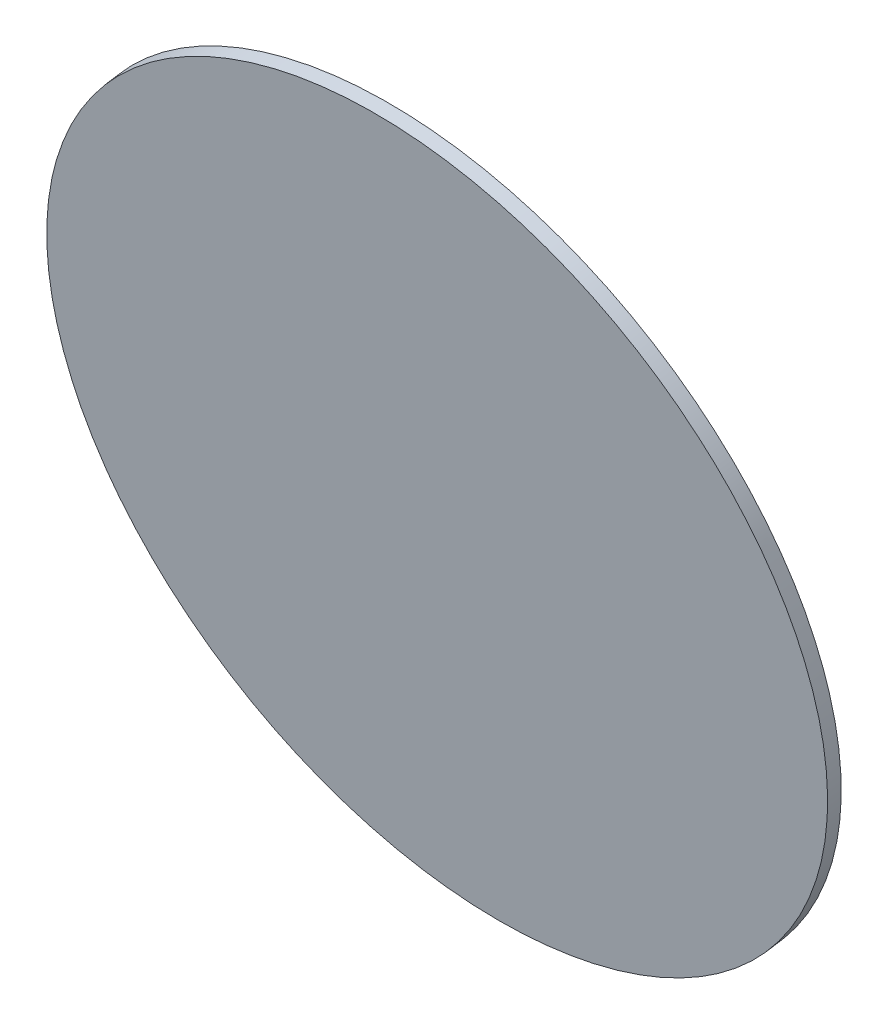
ISO-10303-21;
HEADER;
FILE_DESCRIPTION(('STEP AP214'),'2;1');
FILE_NAME('part.step','',(''),(''),'','','');
FILE_SCHEMA(('AUTOMOTIVE_DESIGN { 1 0 10303 214 1 1 1 1 }'));
ENDSEC;
DATA;
#1=APPLICATION_CONTEXT('core data for automotive mechanical design processes');
#2=APPLICATION_PROTOCOL_DEFINITION('international standard','automotive_design',2000,#1);
#3=PRODUCT_CONTEXT('',#1,'mechanical');
#4=PRODUCT('Part','Part','',(#3));
#5=PRODUCT_RELATED_PRODUCT_CATEGORY('part','',(#4));
#6=PRODUCT_DEFINITION_FORMATION('','',#4);
#7=PRODUCT_DEFINITION_CONTEXT('part definition',#1,'design');
#8=PRODUCT_DEFINITION('design','',#6,#7);
#9=PRODUCT_DEFINITION_SHAPE('','',#8);
#10=(LENGTH_UNIT() NAMED_UNIT(*) SI_UNIT(.MILLI.,.METRE.));
#11=(NAMED_UNIT(*) PLANE_ANGLE_UNIT() SI_UNIT($,.RADIAN.));
#12=(NAMED_UNIT(*) SI_UNIT($,.STERADIAN.) SOLID_ANGLE_UNIT());
#13=UNCERTAINTY_MEASURE_WITH_UNIT(LENGTH_MEASURE(1.E-05),#10,'distance_accuracy_value','');
#14=(GEOMETRIC_REPRESENTATION_CONTEXT(3) GLOBAL_UNCERTAINTY_ASSIGNED_CONTEXT((#13)) GLOBAL_UNIT_ASSIGNED_CONTEXT((#10,
#11,#12)) REPRESENTATION_CONTEXT('',''));
#15=CARTESIAN_POINT('',(0.,0.,0.));
#16=DIRECTION('',(0.,0.,1.));
#17=DIRECTION('',(1.,0.,0.));
#18=AXIS2_PLACEMENT_3D('',#15,#16,#17);
#19=CARTESIAN_POINT('',(-116.1986852462,0.813976793361711,47.5000510556862));
#20=CARTESIAN_POINT('',(-114.852675448576,0.81397679336171,47.5000510556862));
#21=CARTESIAN_POINT('',(-112.160655853328,1.07567267847633,47.5426527114026));
#22=CARTESIAN_POINT('',(-108.277805665472,2.23821892233583,47.7319044255192));
#23=CARTESIAN_POINT('',(-104.699350437822,4.12609158219481,48.0392325329381));
#24=CARTESIAN_POINT('',(-101.562808197957,6.66674077046605,48.4528265868428));
#25=CARTESIAN_POINT('',(-98.9887145051622,9.76253076365682,48.9567923996878));
#26=CARTESIAN_POINT('',(-97.0759903364821,13.2944920884678,49.5317628479128));
#27=CARTESIAN_POINT('',(-95.8981406090517,17.1268934519332,50.1556421396398));
#28=CARTESIAN_POINT('',(-95.5004294273503,21.1124578188906,50.804454943563));
#29=CARTESIAN_POINT('',(-95.8981406090517,25.0980221858479,51.4532677474863));
#30=CARTESIAN_POINT('',(-97.0759903364821,28.9304235493133,52.0771470392132));
#31=CARTESIAN_POINT('',(-98.9887145051622,32.4623848741243,52.6521174874383));
#32=CARTESIAN_POINT('',(-101.562808197957,35.558174867315,53.1560833002833));
#33=CARTESIAN_POINT('',(-104.699350437822,38.0988240555863,53.5696773541879));
#34=CARTESIAN_POINT('',(-108.277805665472,39.9866967154453,53.8770054616068));
#35=CARTESIAN_POINT('',(-112.160655853328,41.1492429593048,54.0662571757235));
#36=CARTESIAN_POINT('',(-116.1986852462,41.5417867869767,54.130159659298));
#37=CARTESIAN_POINT('',(-120.236714639072,41.1492429593048,54.0662571757235));
#38=CARTESIAN_POINT('',(-124.119564826928,39.9866967154453,53.8770054616068));
#39=CARTESIAN_POINT('',(-127.698020054578,38.0988240555863,53.5696773541879));
#40=CARTESIAN_POINT('',(-130.834562294443,35.5581748673151,53.1560833002833));
#41=CARTESIAN_POINT('',(-133.408655987238,32.4623848741243,52.6521174874383));
#42=CARTESIAN_POINT('',(-135.321380155918,28.9304235493133,52.0771470392132));
#43=CARTESIAN_POINT('',(-136.499229883348,25.0980221858479,51.4532677474863));
#44=CARTESIAN_POINT('',(-136.89694106505,21.1124578188905,50.804454943563));
#45=CARTESIAN_POINT('',(-136.499229883348,17.1268934519332,50.1556421396397));
#46=CARTESIAN_POINT('',(-135.321380155918,13.2944920884678,49.5317628479128));
#47=CARTESIAN_POINT('',(-133.408655987238,9.76253076365682,48.9567923996878));
#48=CARTESIAN_POINT('',(-130.834562294443,6.66674077046605,48.4528265868428));
#49=CARTESIAN_POINT('',(-127.698020054578,4.12609158219482,48.0392325329381));
#50=CARTESIAN_POINT('',(-124.119564826928,2.23821892233583,47.7319044255192));
#51=CARTESIAN_POINT('',(-120.236714639072,1.07567267847633,47.5426527114026));
#52=CARTESIAN_POINT('',(-117.544695043824,0.813976793361711,47.5000510556862));
#53=CARTESIAN_POINT('',(-116.1986852462,0.813976793361711,47.5000510556862));
#54=B_SPLINE_CURVE_WITH_KNOTS('',3,(#19,#20,#21,#22,#23,#24,#25,#26,#27,#28,#29,#30,#31,#32,#33,
#34,#35,#36,#37,#38,#39,#40,#41,#42,#43,#44,#45,#46,#47,#48,#49,#50,#51,#52,#53),.UNSPECIFIED.,
.T.,.F.,(4,1,1,1,1,1,1,1,1,1,1,1,1,1,1,1,1,1,1,1,1,1,1,1,1,1,1,1,1,1,1,1,4),(0.,0.03125,0.0625,
0.09375,0.125,0.15625,0.1875,0.21875,0.25,0.28125,0.3125,0.34375,0.375,0.40625,0.4375,0.46875,
0.5,0.53125,0.5625,0.59375,0.625,0.65625,0.6875,0.71875,0.75,0.78125,0.8125,0.84375,0.875,
0.90625,0.9375,0.96875,1.),.UNSPECIFIED.);
#55=DIRECTION('',(0.,-0.160675602081711,0.987007269930511));
#56=VECTOR('',#55,1.);
#57=SURFACE_OF_LINEAR_EXTRUSION('',#54,#56);
#58=CARTESIAN_POINT('',(-116.1986852462,0.813976793361713,47.5000510556862));
#59=CARTESIAN_POINT('',(-114.852675448576,0.813976793361713,47.5000510556862));
#60=CARTESIAN_POINT('',(-112.160655853328,1.07567267847633,47.5426527114026));
#61=CARTESIAN_POINT('',(-108.277805665472,2.23821892233583,47.7319044255192));
#62=CARTESIAN_POINT('',(-104.699350437822,4.12609158219482,48.0392325329381));
#63=CARTESIAN_POINT('',(-101.562808197957,6.66674077046605,48.4528265868427));
#64=CARTESIAN_POINT('',(-98.9887145051622,9.76253076365682,48.9567923996878));
#65=CARTESIAN_POINT('',(-97.0759903364821,13.2944920884678,49.5317628479128));
#66=CARTESIAN_POINT('',(-95.8981406090517,17.1268934519332,50.1556421396397));
#67=CARTESIAN_POINT('',(-95.5004294273503,21.1124578188906,50.804454943563));
#68=CARTESIAN_POINT('',(-95.8981406090517,25.0980221858479,51.4532677474863));
#69=CARTESIAN_POINT('',(-97.0759903364821,28.9304235493133,52.0771470392132));
#70=CARTESIAN_POINT('',(-98.9887145051622,32.4623848741243,52.6521174874383));
#71=CARTESIAN_POINT('',(-101.562808197957,35.558174867315,53.1560833002833));
#72=CARTESIAN_POINT('',(-104.699350437822,38.0988240555863,53.5696773541879));
#73=CARTESIAN_POINT('',(-108.277805665472,39.9866967154453,53.8770054616068));
#74=CARTESIAN_POINT('',(-112.160655853328,41.1492429593048,54.0662571757235));
#75=CARTESIAN_POINT('',(-116.1986852462,41.5417867869767,54.130159659298));
#76=CARTESIAN_POINT('',(-120.236714639072,41.1492429593048,54.0662571757235));
#77=CARTESIAN_POINT('',(-124.119564826928,39.9866967154453,53.8770054616068));
#78=CARTESIAN_POINT('',(-127.698020054578,38.0988240555863,53.5696773541879));
#79=CARTESIAN_POINT('',(-130.834562294443,35.5581748673151,53.1560833002833));
#80=CARTESIAN_POINT('',(-133.408655987238,32.4623848741243,52.6521174874383));
#81=CARTESIAN_POINT('',(-135.321380155918,28.9304235493133,52.0771470392132));
#82=CARTESIAN_POINT('',(-136.499229883348,25.0980221858479,51.4532677474863));
#83=CARTESIAN_POINT('',(-136.89694106505,21.1124578188906,50.804454943563));
#84=CARTESIAN_POINT('',(-136.499229883348,17.1268934519332,50.1556421396397));
#85=CARTESIAN_POINT('',(-135.321380155918,13.2944920884678,49.5317628479128));
#86=CARTESIAN_POINT('',(-133.408655987238,9.76253076365682,48.9567923996877));
#87=CARTESIAN_POINT('',(-130.834562294443,6.66674077046605,48.4528265868428));
#88=CARTESIAN_POINT('',(-127.698020054578,4.12609158219482,48.0392325329381));
#89=CARTESIAN_POINT('',(-124.119564826928,2.23821892233583,47.7319044255192));
#90=CARTESIAN_POINT('',(-120.236714639072,1.07567267847634,47.5426527114025));
#91=CARTESIAN_POINT('',(-117.544695043824,0.813976793361713,47.5000510556862));
#92=CARTESIAN_POINT('',(-116.1986852462,0.813976793361713,47.5000510556862));
#93=B_SPLINE_CURVE_WITH_KNOTS('',3,(#58,#59,#60,#61,#62,#63,#64,#65,#66,#67,#68,#69,#70,#71,#72,
#73,#74,#75,#76,#77,#78,#79,#80,#81,#82,#83,#84,#85,#86,#87,#88,#89,#90,#91,#92),.UNSPECIFIED.,
.T.,.F.,(4,1,1,1,1,1,1,1,1,1,1,1,1,1,1,1,1,1,1,1,1,1,1,1,1,1,1,1,1,1,1,1,4),(0.,0.03125,0.0625,
0.09375,0.125,0.15625,0.1875,0.21875,0.25,0.28125,0.3125,0.34375,0.375,0.40625,0.4375,0.46875,
0.5,0.53125,0.5625,0.59375,0.625,0.65625,0.6875,0.71875,0.75,0.78125,0.8125,0.84375,0.875,
0.90625,0.9375,0.96875,1.),.UNSPECIFIED.);
#94=CARTESIAN_POINT('',(-116.1986852462,0.813976793361713,47.5000510556862));
#95=VERTEX_POINT('',#94);
#96=EDGE_CURVE('E9',#95,#95,#93,.T.);
#97=ORIENTED_EDGE('',*,*,#96,.T.);
#98=EDGE_LOOP('',(#97));
#99=FACE_BOUND('',#98,.T.);
#100=CARTESIAN_POINT('',(-116.1986852462,0.695727341132371,48.2264405479522));
#101=CARTESIAN_POINT('',(-116.535189761853,0.695727410023787,48.2264405591671));
#102=CARTESIAN_POINT('',(-116.871691828468,0.703905435207787,48.2277718655924));
#103=CARTESIAN_POINT('',(-117.543887746102,0.736538783307611,48.233084271097));
#104=CARTESIAN_POINT('',(-117.879581590822,0.760994232663166,48.2370653907595));
#105=CARTESIAN_POINT('',(-118.54935249424,0.82610381180603,48.2476646245735));
#106=CARTESIAN_POINT('',(-118.883429552939,0.86675794159334,48.2542827387249));
#107=CARTESIAN_POINT('',(-119.549160367412,0.964186806639188,48.2701432516393));
#108=CARTESIAN_POINT('',(-119.88081414199,1.02096141667319,48.279385630017));
#109=CARTESIAN_POINT('',(-120.540888734481,1.15055250788332,48.3004818541674));
#110=CARTESIAN_POINT('',(-120.869309552395,1.22336898905944,48.3123356999403));
#111=CARTESIAN_POINT('',(-121.5221398891,1.38481054391818,48.3386168832894));
#112=CARTESIAN_POINT('',(-121.846549376712,1.47343574039576,48.3530442408555));
#113=CARTESIAN_POINT('',(-122.490581165737,1.66626232396551,48.384434614925));
#114=CARTESIAN_POINT('',(-122.810203467148,1.77046371105767,48.4013976314284));
#115=CARTESIAN_POINT('',(-123.443884865301,1.99421069470909,48.4378215589995));
#116=CARTESIAN_POINT('',(-123.757944005236,2.11375617207087,48.4572824506631));
#117=CARTESIAN_POINT('',(-124.379720661885,2.36795824014193,48.4986641826747));
#118=CARTESIAN_POINT('',(-124.687438178599,2.50261483085119,48.5205850230227));
#119=CARTESIAN_POINT('',(-125.295814280548,2.78666044750633,48.5668250071293));
#120=CARTESIAN_POINT('',(-125.596472810931,2.93604958788398,48.5911441695164));
#121=CARTESIAN_POINT('',(-126.190015906075,3.24918296820513,48.642119370964));
#122=CARTESIAN_POINT('',(-126.482900470836,3.41292720814863,48.6687754100246));
#123=CARTESIAN_POINT('',(-127.060180378055,3.75439383667871,48.7243630007155));
#124=CARTESIAN_POINT('',(-127.344575786438,3.93211611667556,48.7532945346685));
#125=CARTESIAN_POINT('',(-127.904159993456,4.3011603193928,48.8133714979015));
#126=CARTESIAN_POINT('',(-128.179348792091,4.49248224211317,48.8445169271816));
#127=CARTESIAN_POINT('',(-128.719891103001,4.88821620662288,48.9089387353576));
#128=CARTESIAN_POINT('',(-128.985244538859,5.09262835008325,48.9422151308046));
#129=CARTESIAN_POINT('',(-129.505489412876,5.51403498700776,49.0108162112342));
#130=CARTESIAN_POINT('',(-129.760380851035,5.7310294804719,49.0461408962167));
#131=CARTESIAN_POINT('',(-130.25907472395,6.17709338282939,49.1187559500889));
#132=CARTESIAN_POINT('',(-130.502877244829,6.40616269791379,49.1560463037073));
#133=CARTESIAN_POINT('',(-130.978764495033,6.87586687353279,49.2325097741569));
#134=CARTESIAN_POINT('',(-131.210849224359,7.11650173406739,49.2716828909881));
#135=CARTESIAN_POINT('',(-131.66278500634,7.60871621210476,49.3518108292733));
#136=CARTESIAN_POINT('',(-131.882635963952,7.86029591461065,49.3927656645649));
#137=CARTESIAN_POINT('',(-132.309589898095,8.37378138740934,49.4763563229275));
#138=CARTESIAN_POINT('',(-132.516692874626,8.63568715770213,49.5189921459984));
#139=CARTESIAN_POINT('',(-132.917636187372,9.1692063482749,49.6058441072545));
#140=CARTESIAN_POINT('',(-133.111476626595,9.44081969313173,49.6500602331614));
#141=CARTESIAN_POINT('',(-133.485378839842,9.99313337359662,49.7399717625394));
#142=CARTESIAN_POINT('',(-133.665440613864,10.2738337092047,49.7856671660105));
#143=CARTESIAN_POINT('',(-134.011402228265,10.8436131744158,49.8784219626727));
#144=CARTESIAN_POINT('',(-134.177301958624,11.1326923690874,49.9254813664565));
#145=CARTESIAN_POINT('',(-134.494557352642,11.7185237190066,50.0208492606294));
#146=CARTESIAN_POINT('',(-134.645913016302,12.0152758742541,50.0691577510185));
#147=CARTESIAN_POINT('',(-134.93369774222,12.6157475097495,50.1669089474945));
#148=CARTESIAN_POINT('',(-135.070126920416,12.9194669358584,50.216351644768));
#149=CARTESIAN_POINT('',(-135.327675244336,13.53316501617,50.3162559834234));
#150=CARTESIAN_POINT('',(-135.44879439006,13.8431436703726,50.3667176248053));
#151=CARTESIAN_POINT('',(-135.675486726055,14.4685918174454,50.4685347650264));
#152=CARTESIAN_POINT('',(-135.781059795561,14.7840613529491,50.5198902708061));
#153=CARTESIAN_POINT('',(-135.976424702581,15.4197254097493,50.6233704660991));
#154=CARTESIAN_POINT('',(-136.066216540097,15.739919931046,50.6754951556125));
#155=CARTESIAN_POINT('',(-136.229783273562,16.3842682232602,50.7803890636474));
#156=CARTESIAN_POINT('',(-136.303558293923,16.7084219634036,50.8331582771591));
#157=CARTESIAN_POINT('',(-136.434855290863,17.3599203705014,50.9392161573843));
#158=CARTESIAN_POINT('',(-136.492377267442,17.6872650374556,50.9925048240978));
#159=CARTESIAN_POINT('',(-136.591088665691,18.3443462448535,51.0994715322789));
#160=CARTESIAN_POINT('',(-136.632277960488,18.6740828038571,51.1531495767678));
#161=CARTESIAN_POINT('',(-136.698244616696,19.3351513543201,51.2607653873083));
#162=CARTESIAN_POINT('',(-136.723021978107,19.6664833457796,51.3147031533599));
#163=CARTESIAN_POINT('',(-136.756084941282,20.3299463511975,51.422708758893));
#164=CARTESIAN_POINT('',(-136.764370671149,20.6620773589294,51.476776597361));
#165=CARTESIAN_POINT('',(-136.764370671149,21.326339374393,51.5849122742969));
#166=CARTESIAN_POINT('',(-136.756084941282,21.6584703821249,51.6389801127649));
#167=CARTESIAN_POINT('',(-136.723021978107,22.3219333875428,51.7469857182981));
#168=CARTESIAN_POINT('',(-136.698244616696,22.6532653790023,51.8009234843496));
#169=CARTESIAN_POINT('',(-136.632277960488,23.3143339294653,51.9085392948901));
#170=CARTESIAN_POINT('',(-136.591088665691,23.6440704884689,51.9622173393791));
#171=CARTESIAN_POINT('',(-136.492377267442,24.3011516958668,52.0691840475601));
#172=CARTESIAN_POINT('',(-136.434855290864,24.628496362821,52.1224727142736));
#173=CARTESIAN_POINT('',(-136.303558293923,25.2799947699188,52.2285305944988));
#174=CARTESIAN_POINT('',(-136.229783273562,25.6041485100623,52.2812998080105));
#175=CARTESIAN_POINT('',(-136.066216540097,26.2484968022765,52.3861937160454));
#176=CARTESIAN_POINT('',(-135.976424702581,26.5686913235731,52.4383184055588));
#177=CARTESIAN_POINT('',(-135.781059795561,27.2043553803734,52.5417986008519));
#178=CARTESIAN_POINT('',(-135.675486726055,27.519824915877,52.5931541066315));
#179=CARTESIAN_POINT('',(-135.44879439006,28.1452730629498,52.6949712468527));
#180=CARTESIAN_POINT('',(-135.327675244336,28.4552517171525,52.7454328882345));
#181=CARTESIAN_POINT('',(-135.070126920416,29.068949797464,52.8453372268899));
#182=CARTESIAN_POINT('',(-134.93369774222,29.372669223573,52.8947799241634));
#183=CARTESIAN_POINT('',(-134.645913016302,29.9731408590683,52.9925311206394));
#184=CARTESIAN_POINT('',(-134.494557352642,30.2698930143158,53.0408396110286));
#185=CARTESIAN_POINT('',(-134.177301958624,30.855724364235,53.1362075052014));
#186=CARTESIAN_POINT('',(-134.011402228265,31.1448035589066,53.1832669089852));
#187=CARTESIAN_POINT('',(-133.665440613864,31.7145830241178,53.2760217056475));
#188=CARTESIAN_POINT('',(-133.485378839842,31.9952833597258,53.3217171091186));
#189=CARTESIAN_POINT('',(-133.111476626596,32.5475970401907,53.4116286384966));
#190=CARTESIAN_POINT('',(-132.917636187372,32.8192103850475,53.4558447644035));
#191=CARTESIAN_POINT('',(-132.516692874626,33.3527295756203,53.5426967256595));
#192=CARTESIAN_POINT('',(-132.309589898095,33.6146353459131,53.5853325487304));
#193=CARTESIAN_POINT('',(-131.882635963952,34.1281208187117,53.668923207093));
#194=CARTESIAN_POINT('',(-131.66278500634,34.3797005212177,53.7098780423847));
#195=CARTESIAN_POINT('',(-131.210849224359,34.871914999255,53.7900059806698));
#196=CARTESIAN_POINT('',(-130.978764495033,35.1125498597896,53.829179097501));
#197=CARTESIAN_POINT('',(-130.502877244829,35.5822540354086,53.9056425679506));
#198=CARTESIAN_POINT('',(-130.25907472395,35.811323350493,53.942932921569));
#199=CARTESIAN_POINT('',(-129.760380851035,36.2573872528505,54.0155479754412));
#200=CARTESIAN_POINT('',(-129.505489412876,36.4743817463147,54.0508726604237));
#201=CARTESIAN_POINT('',(-128.985244538859,36.8957883832392,54.1194737408533));
#202=CARTESIAN_POINT('',(-128.719891103001,37.1002005266996,54.1527501363003));
#203=CARTESIAN_POINT('',(-128.179348792091,37.4959344912093,54.2171719444763));
#204=CARTESIAN_POINT('',(-127.904159993456,37.6872564139296,54.2483173737564));
#205=CARTESIAN_POINT('',(-127.344575786438,38.0563006166468,54.3083943369894));
#206=CARTESIAN_POINT('',(-127.060180378056,38.2340228966437,54.3373258709424));
#207=CARTESIAN_POINT('',(-126.482900470836,38.5754895251739,54.3929134616334));
#208=CARTESIAN_POINT('',(-126.190015906073,38.7392337651174,54.4195695006939));
#209=CARTESIAN_POINT('',(-125.596472810934,39.0523671454383,54.4705447021415));
#210=CARTESIAN_POINT('',(-125.295814280558,39.2017562858156,54.4948638645285));
#211=CARTESIAN_POINT('',(-124.687438178589,39.4858019024717,54.5411038486353));
#212=CARTESIAN_POINT('',(-124.379720661847,39.6204584931823,54.5630246889836));
#213=CARTESIAN_POINT('',(-123.757944005273,39.8746605612497,54.6044064209945));
#214=CARTESIAN_POINT('',(-123.443884865441,39.9942060386065,54.6238673126573));
#215=CARTESIAN_POINT('',(-122.810203467008,40.2179530222716,54.6602912402307));
#216=CARTESIAN_POINT('',(-122.490581165213,40.3221544093824,54.6772542567371));
#217=CARTESIAN_POINT('',(-121.846549377236,40.5149809929012,54.7086446307983));
#218=CARTESIAN_POINT('',(-121.522139891053,40.6036061893091,54.723071988353));
#219=CARTESIAN_POINT('',(-120.869309550442,40.7650477443581,54.7493531717331));
#220=CARTESIAN_POINT('',(-120.540888727193,40.8378642257942,54.7612070175483));
#221=CARTESIAN_POINT('',(-119.880814149279,40.9674553162941,54.7823032415832));
#222=CARTESIAN_POINT('',(-119.549160394613,41.0242299253579,54.7915456198028));
#223=CARTESIAN_POINT('',(-118.883429525737,41.1216587930544,54.8074061331488));
#224=CARTESIAN_POINT('',(-118.549352392722,41.1623129264626,54.8140242478897));
#225=CARTESIAN_POINT('',(-117.879581692341,41.227422495713,54.8246234800932));
#226=CARTESIAN_POINT('',(-117.543888124974,41.2518779315552,54.8286045975559));
#227=CARTESIAN_POINT('',(-116.8716914496,41.2845113165741,54.8339170090706));
#228=CARTESIAN_POINT('',(-116.5351883479,41.29268939219,54.8352483237058));
#229=CARTESIAN_POINT('',(-115.8621821445,41.2926893921901,54.8352483237058));
#230=CARTESIAN_POINT('',(-115.5256790428,41.2845113165741,54.8339170090706));
#231=CARTESIAN_POINT('',(-114.853482367426,41.2518779315552,54.8286045975559));
#232=CARTESIAN_POINT('',(-114.517788800059,41.227422495713,54.8246234800932));
#233=CARTESIAN_POINT('',(-113.848018099678,41.1623129264626,54.8140242478897));
#234=CARTESIAN_POINT('',(-113.513940966663,41.1216587930544,54.8074061331488));
#235=CARTESIAN_POINT('',(-112.848210097787,41.0242299253579,54.7915456198028));
#236=CARTESIAN_POINT('',(-112.516556343121,40.9674553162941,54.7823032415832));
#237=CARTESIAN_POINT('',(-111.856481765207,40.8378642257942,54.7612070175483));
#238=CARTESIAN_POINT('',(-111.528060941958,40.7650477443581,54.7493531717331));
#239=CARTESIAN_POINT('',(-110.875230601347,40.6036061893091,54.723071988353));
#240=CARTESIAN_POINT('',(-110.550821115164,40.5149809929012,54.7086446307983));
#241=CARTESIAN_POINT('',(-109.906789327187,40.3221544093824,54.6772542567371));
#242=CARTESIAN_POINT('',(-109.587167025392,40.2179530222716,54.6602912402307));
#243=CARTESIAN_POINT('',(-108.953485626959,39.9942060386065,54.6238673126573));
#244=CARTESIAN_POINT('',(-108.639426487127,39.8746605612497,54.6044064209945));
#245=CARTESIAN_POINT('',(-108.017649830553,39.6204584931823,54.5630246889836));
#246=CARTESIAN_POINT('',(-107.709932313811,39.4858019024717,54.5411038486353));
#247=CARTESIAN_POINT('',(-107.101556211842,39.2017562858156,54.4948638645285));
#248=CARTESIAN_POINT('',(-106.800897681466,39.0523671454383,54.4705447021415));
#249=CARTESIAN_POINT('',(-106.207354586327,38.7392337651174,54.4195695006939));
#250=CARTESIAN_POINT('',(-105.914470021564,38.5754895251738,54.3929134616333));
#251=CARTESIAN_POINT('',(-105.337190114344,38.2340228966437,54.3373258709424));
#252=CARTESIAN_POINT('',(-105.052794705962,38.0563006166468,54.3083943369894));
#253=CARTESIAN_POINT('',(-104.493210498944,37.6872564139296,54.2483173737564));
#254=CARTESIAN_POINT('',(-104.218021700309,37.4959344912092,54.2171719444763));
#255=CARTESIAN_POINT('',(-103.677479389399,37.1002005266995,54.1527501363003));
#256=CARTESIAN_POINT('',(-103.412125953541,36.8957883832392,54.1194737408533));
#257=CARTESIAN_POINT('',(-102.891881079524,36.4743817463147,54.0508726604237));
#258=CARTESIAN_POINT('',(-102.636989641365,36.2573872528505,54.0155479754412));
#259=CARTESIAN_POINT('',(-102.13829576845,35.811323350493,53.942932921569));
#260=CARTESIAN_POINT('',(-101.894493247571,35.5822540354086,53.9056425679506));
#261=CARTESIAN_POINT('',(-101.418605997367,35.1125498597896,53.829179097501));
#262=CARTESIAN_POINT('',(-101.186521268041,34.871914999255,53.7900059806698));
#263=CARTESIAN_POINT('',(-100.73458548606,34.3797005212176,53.7098780423847));
#264=CARTESIAN_POINT('',(-100.514734528448,34.1281208187117,53.668923207093));
#265=CARTESIAN_POINT('',(-100.087780594305,33.6146353459131,53.5853325487305));
#266=CARTESIAN_POINT('',(-99.8806776177737,33.3527295756203,53.5426967256595));
#267=CARTESIAN_POINT('',(-99.4797343050283,32.8192103850475,53.4558447644035));
#268=CARTESIAN_POINT('',(-99.2858938658045,32.5475970401907,53.4116286384966));
#269=CARTESIAN_POINT('',(-98.9119916525582,31.9952833597258,53.3217171091186));
#270=CARTESIAN_POINT('',(-98.7319298785357,31.7145830241178,53.2760217056475));
#271=CARTESIAN_POINT('',(-98.3859682641352,31.1448035589066,53.1832669089852));
#272=CARTESIAN_POINT('',(-98.2200685337765,30.855724364235,53.1362075052015));
#273=CARTESIAN_POINT('',(-97.902813139758,30.2698930143158,53.0408396110286));
#274=CARTESIAN_POINT('',(-97.7514574760983,29.9731408590683,52.9925311206394));
#275=CARTESIAN_POINT('',(-97.4636727501802,29.3726692235729,52.8947799241634));
#276=CARTESIAN_POINT('',(-97.3272435719837,29.068949797464,52.8453372268899));
#277=CARTESIAN_POINT('',(-97.0696952480638,28.4552517171524,52.7454328882345));
#278=CARTESIAN_POINT('',(-96.9485761023403,28.1452730629498,52.6949712468527));
#279=CARTESIAN_POINT('',(-96.7218837663448,27.519824915877,52.5931541066315));
#280=CARTESIAN_POINT('',(-96.6163106968393,27.2043553803734,52.5417986008519));
#281=CARTESIAN_POINT('',(-96.4209457898186,26.5686913235731,52.4383184055588));
#282=CARTESIAN_POINT('',(-96.3311539523034,26.2484968022764,52.3861937160454));
#283=CARTESIAN_POINT('',(-96.1675872188381,25.6041485100622,52.2812998080105));
#284=CARTESIAN_POINT('',(-96.0938121984766,25.2799947699188,52.2285305944988));
#285=CARTESIAN_POINT('',(-95.9625152015365,24.628496362821,52.1224727142736));
#286=CARTESIAN_POINT('',(-95.9049932249579,24.3011516958668,52.0691840475601));
#287=CARTESIAN_POINT('',(-95.8062818267092,23.6440704884689,51.9622173393791));
#288=CARTESIAN_POINT('',(-95.7650925319119,23.3143339294653,51.9085392948901));
#289=CARTESIAN_POINT('',(-95.6991258757039,22.6532653790023,51.8009234843496));
#290=CARTESIAN_POINT('',(-95.674348514293,22.3219333875428,51.7469857182981));
#291=CARTESIAN_POINT('',(-95.6412855511183,21.6584703821249,51.6389801127649));
#292=CARTESIAN_POINT('',(-95.6329998212508,21.326339374393,51.5849122742969));
#293=CARTESIAN_POINT('',(-95.6329998212508,20.6620773589294,51.476776597361));
#294=CARTESIAN_POINT('',(-95.6412855511183,20.3299463511975,51.422708758893));
#295=CARTESIAN_POINT('',(-95.6743485142931,19.6664833457796,51.3147031533599));
#296=CARTESIAN_POINT('',(-95.6991258757039,19.3351513543201,51.2607653873083));
#297=CARTESIAN_POINT('',(-95.7650925319119,18.6740828038571,51.1531495767678));
#298=CARTESIAN_POINT('',(-95.8062818267092,18.3443462448535,51.0994715322789));
#299=CARTESIAN_POINT('',(-95.9049932249579,17.6872650374556,50.9925048240978));
#300=CARTESIAN_POINT('',(-95.9625152015365,17.3599203705014,50.9392161573844));
#301=CARTESIAN_POINT('',(-96.0938121984766,16.7084219634036,50.8331582771591));
#302=CARTESIAN_POINT('',(-96.1675872188381,16.3842682232602,50.7803890636474));
#303=CARTESIAN_POINT('',(-96.3311539523034,15.739919931046,50.6754951556125));
#304=CARTESIAN_POINT('',(-96.4209457898186,15.4197254097493,50.6233704660991));
#305=CARTESIAN_POINT('',(-96.6163106968393,14.7840613529491,50.5198902708061));
#306=CARTESIAN_POINT('',(-96.7218837663448,14.4685918174454,50.4685347650264));
#307=CARTESIAN_POINT('',(-96.9485761023403,13.8431436703726,50.3667176248052));
#308=CARTESIAN_POINT('',(-97.0696952480638,13.53316501617,50.3162559834234));
#309=CARTESIAN_POINT('',(-97.3272435719837,12.9194669358584,50.216351644768));
#310=CARTESIAN_POINT('',(-97.4636727501802,12.6157475097495,50.1669089474945));
#311=CARTESIAN_POINT('',(-97.7514574760983,12.0152758742541,50.0691577510185));
#312=CARTESIAN_POINT('',(-97.902813139758,11.7185237190066,50.0208492606294));
#313=CARTESIAN_POINT('',(-98.2200685337765,11.1326923690874,49.9254813664565));
#314=CARTESIAN_POINT('',(-98.3859682641352,10.8436131744158,49.8784219626727));
#315=CARTESIAN_POINT('',(-98.7319298785357,10.2738337092047,49.7856671660105));
#316=CARTESIAN_POINT('',(-98.9119916525582,9.99313337359662,49.7399717625394));
#317=CARTESIAN_POINT('',(-99.2858938658045,9.44081969313174,49.6500602331614));
#318=CARTESIAN_POINT('',(-99.4797343050283,9.1692063482749,49.6058441072545));
#319=CARTESIAN_POINT('',(-99.8806776177737,8.63568715770213,49.5189921459984));
#320=CARTESIAN_POINT('',(-100.087780594305,8.37378138740935,49.4763563229275));
#321=CARTESIAN_POINT('',(-100.514734528448,7.86029591461066,49.3927656645649));
#322=CARTESIAN_POINT('',(-100.73458548606,7.60871621210477,49.3518108292733));
#323=CARTESIAN_POINT('',(-101.186521268041,7.1165017340674,49.2716828909881));
#324=CARTESIAN_POINT('',(-101.418605997367,6.8758668735328,49.2325097741569));
#325=CARTESIAN_POINT('',(-101.894493247571,6.4061626979138,49.1560463037073));
#326=CARTESIAN_POINT('',(-102.13829576845,6.17709338282939,49.1187559500889));
#327=CARTESIAN_POINT('',(-102.636989641365,5.73102948047189,49.0461408962167));
#328=CARTESIAN_POINT('',(-102.891881079524,5.51403498700776,49.0108162112342));
#329=CARTESIAN_POINT('',(-103.412125953541,5.09262835008326,48.9422151308046));
#330=CARTESIAN_POINT('',(-103.677479389399,4.88821620662289,48.9089387353576));
#331=CARTESIAN_POINT('',(-104.218021700308,4.49248224211318,48.8445169271816));
#332=CARTESIAN_POINT('',(-104.493210498944,4.3011603193928,48.8133714979015));
#333=CARTESIAN_POINT('',(-105.052794705962,3.93211611667556,48.7532945346685));
#334=CARTESIAN_POINT('',(-105.337190114345,3.7543938366787,48.7243630007155));
#335=CARTESIAN_POINT('',(-105.914470021564,3.41292720814862,48.6687754100246));
#336=CARTESIAN_POINT('',(-106.207354586325,3.24918296820513,48.642119370964));
#337=CARTESIAN_POINT('',(-106.800897681469,2.93604958788398,48.5911441695164));
#338=CARTESIAN_POINT('',(-107.101556211852,2.78666044750632,48.5668250071293));
#339=CARTESIAN_POINT('',(-107.709932313801,2.50261483085119,48.5205850230227));
#340=CARTESIAN_POINT('',(-108.017649830515,2.36795824014193,48.4986641826747));
#341=CARTESIAN_POINT('',(-108.639426487164,2.11375617207088,48.4572824506631));
#342=CARTESIAN_POINT('',(-108.953485627099,1.99421069470909,48.4378215589995));
#343=CARTESIAN_POINT('',(-109.587167025251,1.77046371105767,48.4013976314284));
#344=CARTESIAN_POINT('',(-109.906789326663,1.66626232396551,48.384434614925));
#345=CARTESIAN_POINT('',(-110.550821115688,1.47343574039576,48.3530442408555));
#346=CARTESIAN_POINT('',(-110.8752306033,1.38481054391818,48.3386168832894));
#347=CARTESIAN_POINT('',(-111.528060940005,1.22336898905944,48.3123356999403));
#348=CARTESIAN_POINT('',(-111.856481757919,1.15055250788332,48.3004818541675));
#349=CARTESIAN_POINT('',(-112.51655635041,1.02096141667319,48.279385630017));
#350=CARTESIAN_POINT('',(-112.848210124988,0.964186806639187,48.2701432516393));
#351=CARTESIAN_POINT('',(-113.513940939461,0.866757941593339,48.2542827387249));
#352=CARTESIAN_POINT('',(-113.84801799816,0.826103811806029,48.2476646245735));
#353=CARTESIAN_POINT('',(-114.517788901578,0.760994232663165,48.2370653907595));
#354=CARTESIAN_POINT('',(-114.853482746298,0.73653878330761,48.233084271097));
#355=CARTESIAN_POINT('',(-115.525678663932,0.703905435207787,48.2277718655924));
#356=CARTESIAN_POINT('',(-115.862180730547,0.695727410023787,48.2264405591671));
#357=CARTESIAN_POINT('',(-116.1986852462,0.695727341132371,48.2264405479522));
#358=B_SPLINE_CURVE_WITH_KNOTS('',3,(#100,#101,#102,#103,#104,#105,#106,#107,#108,#109,#110,
#111,#112,#113,#114,#115,#116,#117,#118,#119,#120,#121,#122,#123,#124,#125,#126,#127,#128,#129,
#130,#131,#132,#133,#134,#135,#136,#137,#138,#139,#140,#141,#142,#143,#144,#145,#146,#147,#148,
#149,#150,#151,#152,#153,#154,#155,#156,#157,#158,#159,#160,#161,#162,#163,#164,#165,#166,#167,
#168,#169,#170,#171,#172,#173,#174,#175,#176,#177,#178,#179,#180,#181,#182,#183,#184,#185,#186,
#187,#188,#189,#190,#191,#192,#193,#194,#195,#196,#197,#198,#199,#200,#201,#202,#203,#204,#205,
#206,#207,#208,#209,#210,#211,#212,#213,#214,#215,#216,#217,#218,#219,#220,#221,#222,#223,#224,
#225,#226,#227,#228,#229,#230,#231,#232,#233,#234,#235,#236,#237,#238,#239,#240,#241,#242,#243,
#244,#245,#246,#247,#248,#249,#250,#251,#252,#253,#254,#255,#256,#257,#258,#259,#260,#261,#262,
#263,#264,#265,#266,#267,#268,#269,#270,#271,#272,#273,#274,#275,#276,#277,#278,#279,#280,#281,
#282,#283,#284,#285,#286,#287,#288,#289,#290,#291,#292,#293,#294,#295,#296,#297,#298,#299,#300,
#301,#302,#303,#304,#305,#306,#307,#308,#309,#310,#311,#312,#313,#314,#315,#316,#317,#318,#319,
#320,#321,#322,#323,#324,#325,#326,#327,#328,#329,#330,#331,#332,#333,#334,#335,#336,#337,#338,
#339,#340,#341,#342,#343,#344,#345,#346,#347,#348,#349,#350,#351,#352,#353,#354,#355,#356,#357),
.UNSPECIFIED.,.F.,.F.,(4,2,2,2,2,2,2,2,2,2,2,2,2,2,2,2,2,2,2,2,2,2,2,2,2,2,2,2,2,2,2,2,2,2,2,2,
2,2,2,2,2,2,2,2,2,2,2,2,2,2,2,2,2,2,2,2,2,2,2,2,2,2,2,2,2,2,2,2,2,2,2,2,2,2,2,2,2,2,2,2,2,2,2,2,
2,2,2,2,2,2,2,2,2,2,2,2,2,2,2,2,2,2,2,2,2,2,2,2,2,2,2,2,2,2,2,2,2,2,2,2,2,2,2,2,2,2,2,2,4),(0.,
1.00940835696336,2.0188245548977,3.02824075283205,4.0376491097954,5.04705746675879,
6.05647366469315,7.0658898626275,8.07529821959089,9.08470657655425,10.0941227744886,
11.1035389724229,12.1129473293863,13.1223556863497,14.131771884284,15.1411880822184,
16.1505964391818,17.1600047961451,18.1694209940795,19.1788371920139,20.1882455489772,
21.1976539059406,22.207070103875,23.2164863018093,24.2258946587727,25.2353030157361,
26.2447192136704,27.2541354116048,28.2635437685681,29.2729521255315,30.2823683234659,
31.2917845214002,32.3011928783636,33.310601235327,34.3200174332613,35.3294336311957,
36.3388419881591,37.3482503451225,38.3576665430568,39.3670827409912,40.3764910979545,
41.3858994549179,42.3953156528523,43.4047318507866,44.41414020775,45.4235485647133,
46.4329647626477,47.4423809605821,48.4517893175454,49.4611976745088,50.4706138724432,
51.4800300703775,52.4894384273409,53.4988467843042,54.5082629822386,55.517679180173,
56.5270875371364,57.5364958940997,58.5459120920341,59.5553282899684,60.5647366469318,
61.5741450038952,62.5835612018295,63.5929773997639,64.6023857567272,65.6117941136906,
66.621210311625,67.6306265095593,68.6400348665227,69.6494432234861,70.6588594214204,
71.6682756193548,72.6776839763182,73.6870923332815,74.6965085312159,75.7059247291502,
76.7153330861136,77.724741443077,78.7341576410113,79.7435738389457,80.7529821959091,
81.7623905528724,82.7718067508068,83.7812229487412,84.7906313057045,85.8000396626679,
86.8094558606023,87.8188720585366,88.8282804155,89.8376887724634,90.8471049703977,
91.8565211683321,92.8659295252955,93.8753378822588,94.8847540801932,95.8941702781275,
96.9035786350909,97.9129869920543,98.9224031899886,99.931819387923,100.941227744886,
101.95063610185,102.960052299784,103.969468497718,104.978876854682,105.988285211645,
106.99770140958,108.007117607514,109.016525964477,110.025934321441,111.035350519375,
112.044766717309,113.054175074273,114.063583431236,115.07299962917,116.082415827105,
117.091824184068,118.101232541032,119.110648738966,120.1200649369,121.129473293864,
122.138881650827,123.148297848761,124.157714046696,125.167122403659,126.176530760622,
127.185946958557,128.195363156491,129.204771513455),.UNSPECIFIED.);
#359=CARTESIAN_POINT('',(-116.1986852462,0.695727341132371,48.2264405479522));
#360=VERTEX_POINT('',#359);
#361=EDGE_CURVE('E24',#360,#360,#358,.F.);
#362=ORIENTED_EDGE('',*,*,#361,.F.);
#363=EDGE_LOOP('',(#362));
#364=FACE_BOUND('',#363,.T.);
#365=ADVANCED_FACE('F14',(#99,#364),#57,.T.);
#366=CARTESIAN_POINT('',(-116.1986852462,-15.9349678825771,44.7734786665799));
#367=DIRECTION('',(0.,-0.160675602081711,0.98700726993051));
#368=DIRECTION('',(1.,0.,0.));
#369=AXIS2_PLACEMENT_3D('',#366,#367,#368);
#370=PLANE('',#369);
#371=ORIENTED_EDGE('',*,*,#96,.F.);
#372=EDGE_LOOP('',(#371));
#373=FACE_BOUND('',#372,.T.);
#374=ADVANCED_FACE('F62',(#373),#370,.F.);
#375=CARTESIAN_POINT('',(-116.1986852462,-16.0532173348065,45.4998681588459));
#376=DIRECTION('',(0.,-0.160675602081711,0.98700726993051));
#377=DIRECTION('',(1.,0.,0.));
#378=AXIS2_PLACEMENT_3D('',#375,#376,#377);
#379=PLANE('',#378);
#380=ORIENTED_EDGE('',*,*,#361,.T.);
#381=EDGE_LOOP('',(#380));
#382=FACE_BOUND('',#381,.T.);
#383=ADVANCED_FACE('F31',(#382),#379,.T.);
#384=CLOSED_SHELL('',(#365,#374,#383));
#385=MANIFOLD_SOLID_BREP('B1',#384);
#386=ADVANCED_BREP_SHAPE_REPRESENTATION('',(#18,#385),#14);
#387=SHAPE_DEFINITION_REPRESENTATION(#9,#386);
ENDSEC;
END-ISO-10303-21;
